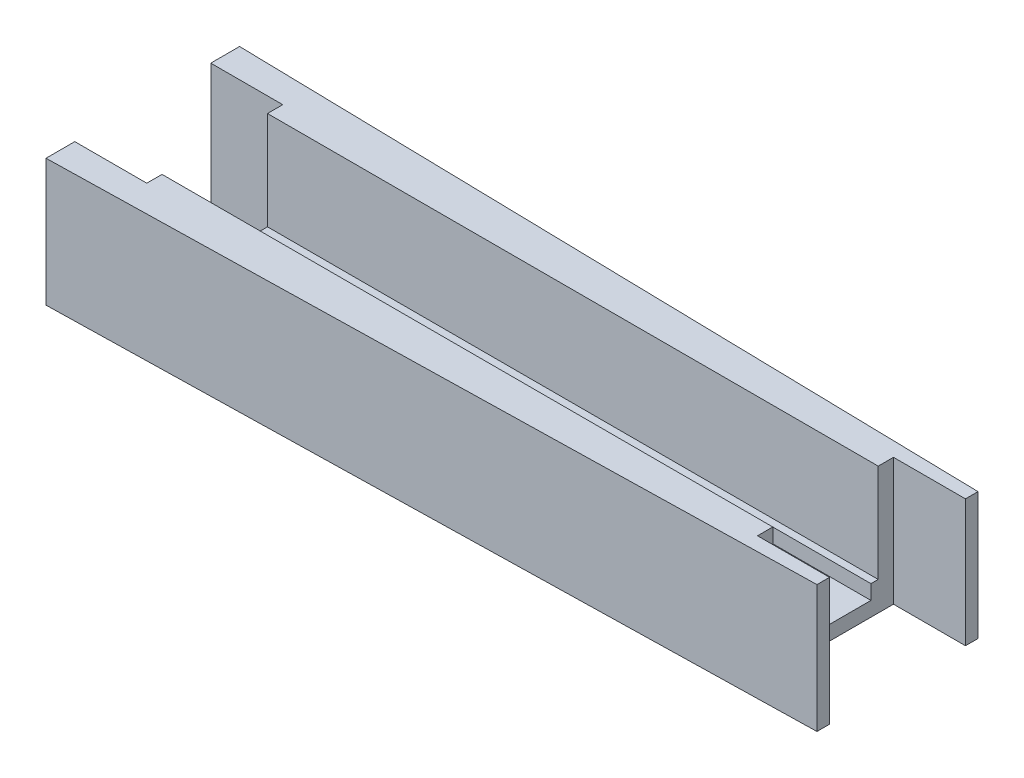
ISO-10303-21;
HEADER;
FILE_DESCRIPTION(('STEP AP214'),'2;1');
FILE_NAME('part.step','',(''),(''),'','','');
FILE_SCHEMA(('AUTOMOTIVE_DESIGN { 1 0 10303 214 1 1 1 1 }'));
ENDSEC;
DATA;
#1=APPLICATION_CONTEXT('core data for automotive mechanical design processes');
#2=APPLICATION_PROTOCOL_DEFINITION('international standard','automotive_design',2000,#1);
#3=PRODUCT_CONTEXT('',#1,'mechanical');
#4=PRODUCT('Part','Part','',(#3));
#5=PRODUCT_RELATED_PRODUCT_CATEGORY('part','',(#4));
#6=PRODUCT_DEFINITION_FORMATION('','',#4);
#7=PRODUCT_DEFINITION_CONTEXT('part definition',#1,'design');
#8=PRODUCT_DEFINITION('design','',#6,#7);
#9=PRODUCT_DEFINITION_SHAPE('','',#8);
#10=(LENGTH_UNIT() NAMED_UNIT(*) SI_UNIT(.MILLI.,.METRE.));
#11=(NAMED_UNIT(*) PLANE_ANGLE_UNIT() SI_UNIT($,.RADIAN.));
#12=(NAMED_UNIT(*) SI_UNIT($,.STERADIAN.) SOLID_ANGLE_UNIT());
#13=UNCERTAINTY_MEASURE_WITH_UNIT(LENGTH_MEASURE(1.E-05),#10,'distance_accuracy_value','');
#14=(GEOMETRIC_REPRESENTATION_CONTEXT(3) GLOBAL_UNCERTAINTY_ASSIGNED_CONTEXT((#13)) GLOBAL_UNIT_ASSIGNED_CONTEXT((#10,
#11,#12)) REPRESENTATION_CONTEXT('',''));
#15=CARTESIAN_POINT('',(0.,0.,0.));
#16=DIRECTION('',(0.,0.,1.));
#17=DIRECTION('',(1.,0.,0.));
#18=AXIS2_PLACEMENT_3D('',#15,#16,#17);
#19=CARTESIAN_POINT('',(0.,4.,0.));
#20=DIRECTION('',(0.,1.,0.));
#21=DIRECTION('',(0.,0.,1.));
#22=AXIS2_PLACEMENT_3D('',#19,#20,#21);
#23=PLANE('',#22);
#24=DIRECTION('',(1.,0.,0.));
#25=VECTOR('',#24,1.);
#26=CARTESIAN_POINT('',(15.,4.,-6.25));
#27=LINE('',#26,#25);
#28=CARTESIAN_POINT('',(88.5,4.,-6.25));
#29=VERTEX_POINT('',#28);
#30=CARTESIAN_POINT('',(172.5,4.,-6.25000000000001));
#31=VERTEX_POINT('',#30);
#32=EDGE_CURVE('E37',#29,#31,#27,.T.);
#33=ORIENTED_EDGE('',*,*,#32,.T.);
#34=DIRECTION('',(0.,0.,-1.));
#35=VECTOR('',#34,1.);
#36=CARTESIAN_POINT('',(172.5,4.,0.));
#37=LINE('',#36,#35);
#38=CARTESIAN_POINT('',(172.5,4.,-7.25));
#39=VERTEX_POINT('',#38);
#40=EDGE_CURVE('E228',#31,#39,#37,.T.);
#41=ORIENTED_EDGE('',*,*,#40,.T.);
#42=DIRECTION('',(-1.,0.,0.));
#43=VECTOR('',#42,1.);
#44=CARTESIAN_POINT('',(15.,4.,-7.25));
#45=LINE('',#44,#43);
#46=CARTESIAN_POINT('',(88.5,4.,-7.25));
#47=VERTEX_POINT('',#46);
#48=EDGE_CURVE('E226',#39,#47,#45,.T.);
#49=ORIENTED_EDGE('',*,*,#48,.T.);
#50=DIRECTION('',(0.,0.,1.));
#51=VECTOR('',#50,1.);
#52=CARTESIAN_POINT('',(88.5,4.,0.));
#53=LINE('',#52,#51);
#54=EDGE_CURVE('E225',#47,#29,#53,.T.);
#55=ORIENTED_EDGE('',*,*,#54,.T.);
#56=EDGE_LOOP('',(#33,#41,#49,#55));
#57=FACE_BOUND('',#56,.T.);
#58=ADVANCED_FACE('F33',(#57),#23,.T.);
#59=CARTESIAN_POINT('',(15.,4.,-6.25));
#60=DIRECTION('',(0.,0.,-1.));
#61=DIRECTION('',(-1.,0.,0.));
#62=AXIS2_PLACEMENT_3D('',#59,#60,#61);
#63=PLANE('',#62);
#64=DIRECTION('',(0.,-1.,0.));
#65=VECTOR('',#64,1.);
#66=CARTESIAN_POINT('',(172.5,4.,-6.25000000000001));
#67=LINE('',#66,#65);
#68=CARTESIAN_POINT('',(172.5,2.,-6.25000000000001));
#69=VERTEX_POINT('',#68);
#70=EDGE_CURVE('E240',#31,#69,#67,.T.);
#71=ORIENTED_EDGE('',*,*,#70,.F.);
#72=ORIENTED_EDGE('',*,*,#32,.F.);
#73=DIRECTION('',(0.,1.,0.));
#74=VECTOR('',#73,1.);
#75=CARTESIAN_POINT('',(88.5,4.,-6.25));
#76=LINE('',#75,#74);
#77=CARTESIAN_POINT('',(88.5,2.,-6.25000000000001));
#78=VERTEX_POINT('',#77);
#79=EDGE_CURVE('E255',#78,#29,#76,.T.);
#80=ORIENTED_EDGE('',*,*,#79,.F.);
#81=DIRECTION('',(1.,0.,0.));
#82=VECTOR('',#81,1.);
#83=CARTESIAN_POINT('',(15.,2.,-6.25));
#84=LINE('',#83,#82);
#85=EDGE_CURVE('E223',#78,#69,#84,.T.);
#86=ORIENTED_EDGE('',*,*,#85,.T.);
#87=EDGE_LOOP('',(#71,#72,#80,#86));
#88=FACE_BOUND('',#87,.T.);
#89=ADVANCED_FACE('F391',(#88),#63,.F.);
#90=CARTESIAN_POINT('',(267.,17.5,0.));
#91=DIRECTION('',(0.,1.,0.));
#92=DIRECTION('',(0.,0.,1.));
#93=AXIS2_PLACEMENT_3D('',#90,#91,#92);
#94=PLANE('',#93);
#95=DIRECTION('',(-1.,0.,0.));
#96=VECTOR('',#95,1.);
#97=CARTESIAN_POINT('',(15.,17.5,-7.25));
#98=LINE('',#97,#96);
#99=CARTESIAN_POINT('',(172.5,17.5,-7.25));
#100=VERTEX_POINT('',#99);
#101=CARTESIAN_POINT('',(88.5,17.5,-7.25));
#102=VERTEX_POINT('',#101);
#103=EDGE_CURVE('E216',#100,#102,#98,.T.);
#104=ORIENTED_EDGE('',*,*,#103,.F.);
#105=DIRECTION('',(0.,0.,1.));
#106=VECTOR('',#105,1.);
#107=CARTESIAN_POINT('',(172.5,17.5,-9.35));
#108=LINE('',#107,#106);
#109=CARTESIAN_POINT('',(172.5,17.5,-9.35));
#110=VERTEX_POINT('',#109);
#111=EDGE_CURVE('E75',#110,#100,#108,.T.);
#112=ORIENTED_EDGE('',*,*,#111,.F.);
#113=DIRECTION('',(-1.,0.,0.));
#114=VECTOR('',#113,1.);
#115=CARTESIAN_POINT('',(172.5,17.5,-9.35));
#116=LINE('',#115,#114);
#117=CARTESIAN_POINT('',(182.4,17.5,-9.35));
#118=VERTEX_POINT('',#117);
#119=EDGE_CURVE('E43',#118,#110,#116,.T.);
#120=ORIENTED_EDGE('',*,*,#119,.F.);
#121=DIRECTION('',(0.,0.,1.));
#122=VECTOR('',#121,1.);
#123=CARTESIAN_POINT('',(182.4,17.5,-9.35));
#124=LINE('',#123,#122);
#125=CARTESIAN_POINT('',(182.4,17.5,-11.0744784778008));
#126=VERTEX_POINT('',#125);
#127=EDGE_CURVE('E300',#126,#118,#124,.T.);
#128=ORIENTED_EDGE('',*,*,#127,.F.);
#129=DIRECTION('',(-0.999768082492875,0.,-0.0215355805243446));
#130=VECTOR('',#129,1.);
#131=CARTESIAN_POINT('',(0.323033707865168,17.5,-14.9965212373931));
#132=LINE('',#131,#130);
#133=CARTESIAN_POINT('',(78.6,17.5,-13.3103902833199));
#134=VERTEX_POINT('',#133);
#135=EDGE_CURVE('E207',#126,#134,#132,.T.);
#136=ORIENTED_EDGE('',*,*,#135,.T.);
#137=DIRECTION('',(0.,0.,-1.));
#138=VECTOR('',#137,1.);
#139=CARTESIAN_POINT('',(78.6,17.5,-9.35));
#140=LINE('',#139,#138);
#141=CARTESIAN_POINT('',(78.6,17.5,-9.35));
#142=VERTEX_POINT('',#141);
#143=EDGE_CURVE('E291',#142,#134,#140,.T.);
#144=ORIENTED_EDGE('',*,*,#143,.F.);
#145=DIRECTION('',(-1.,0.,0.));
#146=VECTOR('',#145,1.);
#147=CARTESIAN_POINT('',(88.5,17.5,-9.35));
#148=LINE('',#147,#146);
#149=CARTESIAN_POINT('',(88.5,17.5,-9.35));
#150=VERTEX_POINT('',#149);
#151=EDGE_CURVE('E257',#150,#142,#148,.T.);
#152=ORIENTED_EDGE('',*,*,#151,.F.);
#153=DIRECTION('',(0.,0.,-1.));
#154=VECTOR('',#153,1.);
#155=CARTESIAN_POINT('',(88.5,17.5,-9.35));
#156=LINE('',#155,#154);
#157=EDGE_CURVE('E252',#102,#150,#156,.T.);
#158=ORIENTED_EDGE('',*,*,#157,.F.);
#159=EDGE_LOOP('',(#104,#112,#120,#128,#136,#144,#152,#158));
#160=FACE_BOUND('',#159,.T.);
#161=ADVANCED_FACE('F331',(#160),#94,.T.);
#162=CARTESIAN_POINT('',(267.,0.,0.));
#163=DIRECTION('',(0.,1.,0.));
#164=DIRECTION('',(0.,0.,1.));
#165=AXIS2_PLACEMENT_3D('',#162,#163,#164);
#166=PLANE('',#165);
#167=DIRECTION('',(0.,0.,1.));
#168=VECTOR('',#167,1.);
#169=CARTESIAN_POINT('',(182.4,0.,9.35));
#170=LINE('',#169,#168);
#171=CARTESIAN_POINT('',(182.4,0.,9.35));
#172=VERTEX_POINT('',#171);
#173=CARTESIAN_POINT('',(182.4,0.,11.0744784778008));
#174=VERTEX_POINT('',#173);
#175=EDGE_CURVE('E188',#172,#174,#170,.T.);
#176=ORIENTED_EDGE('',*,*,#175,.T.);
#177=DIRECTION('',(0.999768082492875,0.,-0.0215355805243446));
#178=VECTOR('',#177,1.);
#179=CARTESIAN_POINT('',(267.19920411985,0.,9.24785476305909));
#180=LINE('',#179,#178);
#181=CARTESIAN_POINT('',(78.6,0.,13.3103902833199));
#182=VERTEX_POINT('',#181);
#183=EDGE_CURVE('E202',#182,#174,#180,.T.);
#184=ORIENTED_EDGE('',*,*,#183,.F.);
#185=DIRECTION('',(0.,0.,1.));
#186=VECTOR('',#185,1.);
#187=CARTESIAN_POINT('',(78.6,0.,0.));
#188=LINE('',#187,#186);
#189=CARTESIAN_POINT('',(78.6,0.,9.35));
#190=VERTEX_POINT('',#189);
#191=EDGE_CURVE('E253',#190,#182,#188,.T.);
#192=ORIENTED_EDGE('',*,*,#191,.F.);
#193=DIRECTION('',(1.,0.,0.));
#194=VECTOR('',#193,1.);
#195=CARTESIAN_POINT('',(88.5,0.,9.35));
#196=LINE('',#195,#194);
#197=CARTESIAN_POINT('',(88.5,0.,9.35));
#198=VERTEX_POINT('',#197);
#199=EDGE_CURVE('E206',#190,#198,#196,.T.);
#200=ORIENTED_EDGE('',*,*,#199,.T.);
#201=DIRECTION('',(0.,0.,-1.));
#202=VECTOR('',#201,1.);
#203=CARTESIAN_POINT('',(88.5,0.,-9.35));
#204=LINE('',#203,#202);
#205=CARTESIAN_POINT('',(88.5,0.,-9.35));
#206=VERTEX_POINT('',#205);
#207=EDGE_CURVE('E279',#198,#206,#204,.T.);
#208=ORIENTED_EDGE('',*,*,#207,.T.);
#209=DIRECTION('',(-1.,0.,0.));
#210=VECTOR('',#209,1.);
#211=CARTESIAN_POINT('',(88.5,0.,-9.35));
#212=LINE('',#211,#210);
#213=CARTESIAN_POINT('',(78.6,0.,-9.35));
#214=VERTEX_POINT('',#213);
#215=EDGE_CURVE('E284',#206,#214,#212,.T.);
#216=ORIENTED_EDGE('',*,*,#215,.T.);
#217=DIRECTION('',(0.,0.,-1.));
#218=VECTOR('',#217,1.);
#219=CARTESIAN_POINT('',(78.6,0.,-9.35));
#220=LINE('',#219,#218);
#221=CARTESIAN_POINT('',(78.6,0.,-13.3103902833199));
#222=VERTEX_POINT('',#221);
#223=EDGE_CURVE('E280',#214,#222,#220,.T.);
#224=ORIENTED_EDGE('',*,*,#223,.T.);
#225=DIRECTION('',(-0.999768082492875,0.,-0.0215355805243446));
#226=VECTOR('',#225,1.);
#227=CARTESIAN_POINT('',(0.323033707865168,0.,-14.9965212373931));
#228=LINE('',#227,#226);
#229=CARTESIAN_POINT('',(182.4,0.,-11.0744784778008));
#230=VERTEX_POINT('',#229);
#231=EDGE_CURVE('E212',#230,#222,#228,.T.);
#232=ORIENTED_EDGE('',*,*,#231,.F.);
#233=DIRECTION('',(0.,0.,-1.));
#234=VECTOR('',#233,1.);
#235=CARTESIAN_POINT('',(182.4,0.,0.));
#236=LINE('',#235,#234);
#237=CARTESIAN_POINT('',(182.4,0.,-9.35));
#238=VERTEX_POINT('',#237);
#239=EDGE_CURVE('E142',#238,#230,#236,.T.);
#240=ORIENTED_EDGE('',*,*,#239,.F.);
#241=DIRECTION('',(-1.,0.,0.));
#242=VECTOR('',#241,1.);
#243=CARTESIAN_POINT('',(172.5,0.,-9.35));
#244=LINE('',#243,#242);
#245=CARTESIAN_POINT('',(172.5,0.,-9.35));
#246=VERTEX_POINT('',#245);
#247=EDGE_CURVE('E283',#238,#246,#244,.T.);
#248=ORIENTED_EDGE('',*,*,#247,.T.);
#249=DIRECTION('',(0.,0.,1.));
#250=VECTOR('',#249,1.);
#251=CARTESIAN_POINT('',(172.5,0.,-9.25000000000001));
#252=LINE('',#251,#250);
#253=CARTESIAN_POINT('',(172.5,0.,9.35));
#254=VERTEX_POINT('',#253);
#255=EDGE_CURVE('E303',#246,#254,#252,.T.);
#256=ORIENTED_EDGE('',*,*,#255,.T.);
#257=DIRECTION('',(1.,0.,0.));
#258=VECTOR('',#257,1.);
#259=CARTESIAN_POINT('',(172.5,0.,9.35));
#260=LINE('',#259,#258);
#261=EDGE_CURVE('E205',#254,#172,#260,.T.);
#262=ORIENTED_EDGE('',*,*,#261,.T.);
#263=EDGE_LOOP('',(#176,#184,#192,#200,#208,#216,#224,#232,#240,#248,#256,#262));
#264=FACE_BOUND('',#263,.T.);
#265=ADVANCED_FACE('F200',(#264),#166,.F.);
#266=DIRECTION('',(1.,0.,0.));
#267=VECTOR('',#266,1.);
#268=CARTESIAN_POINT('',(172.5,17.5,9.35));
#269=LINE('',#268,#267);
#270=CARTESIAN_POINT('',(172.5,17.5,9.35));
#271=VERTEX_POINT('',#270);
#272=CARTESIAN_POINT('',(182.4,17.5,9.35));
#273=VERTEX_POINT('',#272);
#274=EDGE_CURVE('E67',#271,#273,#269,.T.);
#275=ORIENTED_EDGE('',*,*,#274,.F.);
#276=CARTESIAN_POINT('',(172.5,17.5,7.25));
#277=VERTEX_POINT('',#276);
#278=EDGE_CURVE('E249',#277,#271,#108,.T.);
#279=ORIENTED_EDGE('',*,*,#278,.F.);
#280=DIRECTION('',(1.,0.,0.));
#281=VECTOR('',#280,1.);
#282=CARTESIAN_POINT('',(15.,17.5,7.25));
#283=LINE('',#282,#281);
#284=CARTESIAN_POINT('',(88.5,17.5,7.25));
#285=VERTEX_POINT('',#284);
#286=EDGE_CURVE('E246',#285,#277,#283,.T.);
#287=ORIENTED_EDGE('',*,*,#286,.F.);
#288=CARTESIAN_POINT('',(88.5,17.5,9.35));
#289=VERTEX_POINT('',#288);
#290=EDGE_CURVE('E265',#289,#285,#156,.T.);
#291=ORIENTED_EDGE('',*,*,#290,.F.);
#292=DIRECTION('',(1.,0.,0.));
#293=VECTOR('',#292,1.);
#294=CARTESIAN_POINT('',(88.5,17.5,9.35));
#295=LINE('',#294,#293);
#296=CARTESIAN_POINT('',(78.6,17.5,9.35));
#297=VERTEX_POINT('',#296);
#298=EDGE_CURVE('E272',#297,#289,#295,.T.);
#299=ORIENTED_EDGE('',*,*,#298,.F.);
#300=DIRECTION('',(0.,0.,-1.));
#301=VECTOR('',#300,1.);
#302=CARTESIAN_POINT('',(78.6,17.5,9.35));
#303=LINE('',#302,#301);
#304=CARTESIAN_POINT('',(78.6,17.5,13.3103902833199));
#305=VERTEX_POINT('',#304);
#306=EDGE_CURVE('E275',#305,#297,#303,.T.);
#307=ORIENTED_EDGE('',*,*,#306,.F.);
#308=DIRECTION('',(0.999768082492875,0.,-0.0215355805243446));
#309=VECTOR('',#308,1.);
#310=CARTESIAN_POINT('',(267.19920411985,17.5,9.24785476305909));
#311=LINE('',#310,#309);
#312=CARTESIAN_POINT('',(182.4,17.5,11.0744784778008));
#313=VERTEX_POINT('',#312);
#314=EDGE_CURVE('E213',#305,#313,#311,.T.);
#315=ORIENTED_EDGE('',*,*,#314,.T.);
#316=DIRECTION('',(0.,0.,1.));
#317=VECTOR('',#316,1.);
#318=CARTESIAN_POINT('',(182.4,17.5,9.35));
#319=LINE('',#318,#317);
#320=EDGE_CURVE('E191',#273,#313,#319,.T.);
#321=ORIENTED_EDGE('',*,*,#320,.F.);
#322=EDGE_LOOP('',(#275,#279,#287,#291,#299,#307,#315,#321));
#323=FACE_BOUND('',#322,.T.);
#324=ADVANCED_FACE('F351',(#323),#94,.T.);
#325=CARTESIAN_POINT('',(267.19920411985,17.5,9.24785476305909));
#326=DIRECTION('',(-0.0215355805243446,0.,-0.999768082492875));
#327=DIRECTION('',(-0.999768082492875,0.,0.0215355805243446));
#328=AXIS2_PLACEMENT_3D('',#325,#326,#327);
#329=PLANE('',#328);
#330=DIRECTION('',(0.,-1.,0.));
#331=VECTOR('',#330,1.);
#332=CARTESIAN_POINT('',(182.4,17.5,11.0744784778008));
#333=LINE('',#332,#331);
#334=EDGE_CURVE('E185',#313,#174,#333,.T.);
#335=ORIENTED_EDGE('',*,*,#334,.F.);
#336=ORIENTED_EDGE('',*,*,#314,.F.);
#337=DIRECTION('',(0.,1.,0.));
#338=VECTOR('',#337,1.);
#339=CARTESIAN_POINT('',(78.6,17.5,13.3103902833199));
#340=LINE('',#339,#338);
#341=EDGE_CURVE('E211',#182,#305,#340,.T.);
#342=ORIENTED_EDGE('',*,*,#341,.F.);
#343=ORIENTED_EDGE('',*,*,#183,.T.);
#344=EDGE_LOOP('',(#335,#336,#342,#343));
#345=FACE_BOUND('',#344,.T.);
#346=ADVANCED_FACE('F210',(#345),#329,.F.);
#347=CARTESIAN_POINT('',(0.323033707865168,17.5,-14.9965212373931));
#348=DIRECTION('',(-0.0215355805243446,0.,0.999768082492875));
#349=DIRECTION('',(0.999768082492875,0.,0.0215355805243446));
#350=AXIS2_PLACEMENT_3D('',#347,#348,#349);
#351=PLANE('',#350);
#352=DIRECTION('',(0.,1.,0.));
#353=VECTOR('',#352,1.);
#354=CARTESIAN_POINT('',(182.4,17.5,-11.0744784778008));
#355=LINE('',#354,#353);
#356=EDGE_CURVE('E309',#230,#126,#355,.T.);
#357=ORIENTED_EDGE('',*,*,#356,.F.);
#358=ORIENTED_EDGE('',*,*,#231,.T.);
#359=DIRECTION('',(0.,-1.,0.));
#360=VECTOR('',#359,1.);
#361=CARTESIAN_POINT('',(78.6,17.5,-13.3103902833199));
#362=LINE('',#361,#360);
#363=EDGE_CURVE('E261',#134,#222,#362,.T.);
#364=ORIENTED_EDGE('',*,*,#363,.F.);
#365=ORIENTED_EDGE('',*,*,#135,.F.);
#366=EDGE_LOOP('',(#357,#358,#364,#365));
#367=FACE_BOUND('',#366,.T.);
#368=ADVANCED_FACE('F378',(#367),#351,.F.);
#369=CARTESIAN_POINT('',(15.,2.,-7.25));
#370=DIRECTION('',(0.,0.,-1.));
#371=DIRECTION('',(-1.,0.,0.));
#372=AXIS2_PLACEMENT_3D('',#369,#370,#371);
#373=PLANE('',#372);
#374=DIRECTION('',(0.,-1.,0.));
#375=VECTOR('',#374,1.);
#376=CARTESIAN_POINT('',(172.5,2.,-7.25));
#377=LINE('',#376,#375);
#378=EDGE_CURVE('E238',#100,#39,#377,.T.);
#379=ORIENTED_EDGE('',*,*,#378,.F.);
#380=ORIENTED_EDGE('',*,*,#103,.T.);
#381=DIRECTION('',(0.,1.,0.));
#382=VECTOR('',#381,1.);
#383=CARTESIAN_POINT('',(88.5,2.,-7.25));
#384=LINE('',#383,#382);
#385=EDGE_CURVE('E251',#47,#102,#384,.T.);
#386=ORIENTED_EDGE('',*,*,#385,.F.);
#387=ORIENTED_EDGE('',*,*,#48,.F.);
#388=EDGE_LOOP('',(#379,#380,#386,#387));
#389=FACE_BOUND('',#388,.T.);
#390=ADVANCED_FACE('F328',(#389),#373,.F.);
#391=CARTESIAN_POINT('',(0.,4.,0.));
#392=DIRECTION('',(0.,1.,0.));
#393=DIRECTION('',(0.,0.,1.));
#394=AXIS2_PLACEMENT_3D('',#391,#392,#393);
#395=PLANE('',#394);
#396=DIRECTION('',(1.,0.,0.));
#397=VECTOR('',#396,1.);
#398=CARTESIAN_POINT('',(267.,4.,7.25));
#399=LINE('',#398,#397);
#400=CARTESIAN_POINT('',(88.5,4.,7.25000000000002));
#401=VERTEX_POINT('',#400);
#402=CARTESIAN_POINT('',(172.5,4.,7.25));
#403=VERTEX_POINT('',#402);
#404=EDGE_CURVE('E322',#401,#403,#399,.T.);
#405=ORIENTED_EDGE('',*,*,#404,.T.);
#406=DIRECTION('',(0.,0.,-1.));
#407=VECTOR('',#406,1.);
#408=CARTESIAN_POINT('',(172.5,4.,0.));
#409=LINE('',#408,#407);
#410=CARTESIAN_POINT('',(172.5,4.,6.25000000000001));
#411=VERTEX_POINT('',#410);
#412=EDGE_CURVE('E172',#403,#411,#409,.T.);
#413=ORIENTED_EDGE('',*,*,#412,.T.);
#414=DIRECTION('',(-1.,0.,0.));
#415=VECTOR('',#414,1.);
#416=CARTESIAN_POINT('',(267.,4.,6.25));
#417=LINE('',#416,#415);
#418=CARTESIAN_POINT('',(88.5,4.,6.25));
#419=VERTEX_POINT('',#418);
#420=EDGE_CURVE('E319',#411,#419,#417,.T.);
#421=ORIENTED_EDGE('',*,*,#420,.T.);
#422=DIRECTION('',(0.,0.,1.));
#423=VECTOR('',#422,1.);
#424=CARTESIAN_POINT('',(88.5,4.,0.));
#425=LINE('',#424,#423);
#426=EDGE_CURVE('E318',#419,#401,#425,.T.);
#427=ORIENTED_EDGE('',*,*,#426,.T.);
#428=EDGE_LOOP('',(#405,#413,#421,#427));
#429=FACE_BOUND('',#428,.T.);
#430=ADVANCED_FACE('F361',(#429),#395,.T.);
#431=CARTESIAN_POINT('',(267.,4.,6.25));
#432=DIRECTION('',(0.,0.,1.));
#433=DIRECTION('',(1.,0.,0.));
#434=AXIS2_PLACEMENT_3D('',#431,#432,#433);
#435=PLANE('',#434);
#436=DIRECTION('',(0.,1.,0.));
#437=VECTOR('',#436,1.);
#438=CARTESIAN_POINT('',(172.5,4.,6.25000000000001));
#439=LINE('',#438,#437);
#440=CARTESIAN_POINT('',(172.5,2.,6.25000000000001));
#441=VERTEX_POINT('',#440);
#442=EDGE_CURVE('E176',#441,#411,#439,.T.);
#443=ORIENTED_EDGE('',*,*,#442,.F.);
#444=DIRECTION('',(-1.,0.,0.));
#445=VECTOR('',#444,1.);
#446=CARTESIAN_POINT('',(267.,2.,6.25));
#447=LINE('',#446,#445);
#448=CARTESIAN_POINT('',(88.5,2.,6.25000000000002));
#449=VERTEX_POINT('',#448);
#450=EDGE_CURVE('E315',#441,#449,#447,.T.);
#451=ORIENTED_EDGE('',*,*,#450,.T.);
#452=DIRECTION('',(0.,-1.,0.));
#453=VECTOR('',#452,1.);
#454=CARTESIAN_POINT('',(88.5,4.,6.25000000000002));
#455=LINE('',#454,#453);
#456=EDGE_CURVE('E258',#419,#449,#455,.T.);
#457=ORIENTED_EDGE('',*,*,#456,.F.);
#458=ORIENTED_EDGE('',*,*,#420,.F.);
#459=EDGE_LOOP('',(#443,#451,#457,#458));
#460=FACE_BOUND('',#459,.T.);
#461=ADVANCED_FACE('F403',(#460),#435,.F.);
#462=CARTESIAN_POINT('',(15.,2.,7.25));
#463=DIRECTION('',(0.,0.,1.));
#464=DIRECTION('',(1.,0.,0.));
#465=AXIS2_PLACEMENT_3D('',#462,#463,#464);
#466=PLANE('',#465);
#467=DIRECTION('',(0.,1.,0.));
#468=VECTOR('',#467,1.);
#469=CARTESIAN_POINT('',(172.5,2.,7.25));
#470=LINE('',#469,#468);
#471=EDGE_CURVE('E247',#403,#277,#470,.T.);
#472=ORIENTED_EDGE('',*,*,#471,.F.);
#473=ORIENTED_EDGE('',*,*,#404,.F.);
#474=DIRECTION('',(0.,-1.,0.));
#475=VECTOR('',#474,1.);
#476=CARTESIAN_POINT('',(88.5,2.,7.25));
#477=LINE('',#476,#475);
#478=EDGE_CURVE('E262',#285,#401,#477,.T.);
#479=ORIENTED_EDGE('',*,*,#478,.F.);
#480=ORIENTED_EDGE('',*,*,#286,.T.);
#481=EDGE_LOOP('',(#472,#473,#479,#480));
#482=FACE_BOUND('',#481,.T.);
#483=ADVANCED_FACE('F356',(#482),#466,.F.);
#484=CARTESIAN_POINT('',(0.,2.,0.));
#485=DIRECTION('',(0.,1.,0.));
#486=DIRECTION('',(0.,0.,1.));
#487=AXIS2_PLACEMENT_3D('',#484,#485,#486);
#488=PLANE('',#487);
#489=ORIENTED_EDGE('',*,*,#450,.F.);
#490=DIRECTION('',(0.,0.,-1.));
#491=VECTOR('',#490,1.);
#492=CARTESIAN_POINT('',(172.5,2.,0.));
#493=LINE('',#492,#491);
#494=EDGE_CURVE('E242',#441,#69,#493,.T.);
#495=ORIENTED_EDGE('',*,*,#494,.T.);
#496=ORIENTED_EDGE('',*,*,#85,.F.);
#497=DIRECTION('',(0.,0.,1.));
#498=VECTOR('',#497,1.);
#499=CARTESIAN_POINT('',(88.5,2.,0.));
#500=LINE('',#499,#498);
#501=EDGE_CURVE('E245',#78,#449,#500,.T.);
#502=ORIENTED_EDGE('',*,*,#501,.T.);
#503=EDGE_LOOP('',(#489,#495,#496,#502));
#504=FACE_BOUND('',#503,.T.);
#505=ADVANCED_FACE('F35',(#504),#488,.T.);
#506=CARTESIAN_POINT('',(78.6,17.5,-9.35));
#507=DIRECTION('',(-1.,0.,0.));
#508=DIRECTION('',(0.,0.,1.));
#509=AXIS2_PLACEMENT_3D('',#506,#507,#508);
#510=PLANE('',#509);
#511=ORIENTED_EDGE('',*,*,#363,.T.);
#512=ORIENTED_EDGE('',*,*,#223,.F.);
#513=DIRECTION('',(0.,-1.,0.));
#514=VECTOR('',#513,1.);
#515=CARTESIAN_POINT('',(78.6,17.5,-9.35));
#516=LINE('',#515,#514);
#517=EDGE_CURVE('E270',#142,#214,#516,.T.);
#518=ORIENTED_EDGE('',*,*,#517,.F.);
#519=ORIENTED_EDGE('',*,*,#143,.T.);
#520=EDGE_LOOP('',(#511,#512,#518,#519));
#521=FACE_BOUND('',#520,.T.);
#522=ADVANCED_FACE('F380',(#521),#510,.T.);
#523=CARTESIAN_POINT('',(78.6,17.5,9.35));
#524=DIRECTION('',(-1.,0.,0.));
#525=DIRECTION('',(0.,0.,1.));
#526=AXIS2_PLACEMENT_3D('',#523,#524,#525);
#527=PLANE('',#526);
#528=ORIENTED_EDGE('',*,*,#341,.T.);
#529=ORIENTED_EDGE('',*,*,#306,.T.);
#530=DIRECTION('',(0.,-1.,0.));
#531=VECTOR('',#530,1.);
#532=CARTESIAN_POINT('',(78.6,17.5,9.35));
#533=LINE('',#532,#531);
#534=EDGE_CURVE('E273',#297,#190,#533,.T.);
#535=ORIENTED_EDGE('',*,*,#534,.T.);
#536=ORIENTED_EDGE('',*,*,#191,.T.);
#537=EDGE_LOOP('',(#528,#529,#535,#536));
#538=FACE_BOUND('',#537,.T.);
#539=ADVANCED_FACE('F369',(#538),#527,.T.);
#540=CARTESIAN_POINT('',(88.5,17.5,-9.35));
#541=DIRECTION('',(-1.,0.,0.));
#542=DIRECTION('',(0.,0.,1.));
#543=AXIS2_PLACEMENT_3D('',#540,#541,#542);
#544=PLANE('',#543);
#545=ORIENTED_EDGE('',*,*,#385,.T.);
#546=ORIENTED_EDGE('',*,*,#157,.T.);
#547=DIRECTION('',(0.,-1.,0.));
#548=VECTOR('',#547,1.);
#549=CARTESIAN_POINT('',(88.5,17.5,-9.35));
#550=LINE('',#549,#548);
#551=EDGE_CURVE('E267',#150,#206,#550,.T.);
#552=ORIENTED_EDGE('',*,*,#551,.T.);
#553=ORIENTED_EDGE('',*,*,#207,.F.);
#554=DIRECTION('',(0.,-1.,0.));
#555=VECTOR('',#554,1.);
#556=CARTESIAN_POINT('',(88.5,17.5,9.35));
#557=LINE('',#556,#555);
#558=EDGE_CURVE('E196',#289,#198,#557,.T.);
#559=ORIENTED_EDGE('',*,*,#558,.F.);
#560=ORIENTED_EDGE('',*,*,#290,.T.);
#561=ORIENTED_EDGE('',*,*,#478,.T.);
#562=ORIENTED_EDGE('',*,*,#426,.F.);
#563=ORIENTED_EDGE('',*,*,#456,.T.);
#564=ORIENTED_EDGE('',*,*,#501,.F.);
#565=ORIENTED_EDGE('',*,*,#79,.T.);
#566=ORIENTED_EDGE('',*,*,#54,.F.);
#567=EDGE_LOOP('',(#545,#546,#552,#553,#559,#560,#561,#562,#563,#564,#565,#566));
#568=FACE_BOUND('',#567,.T.);
#569=ADVANCED_FACE('F336',(#568),#544,.T.);
#570=CARTESIAN_POINT('',(88.5,17.5,-9.35));
#571=DIRECTION('',(0.,0.,1.));
#572=DIRECTION('',(1.,0.,0.));
#573=AXIS2_PLACEMENT_3D('',#570,#571,#572);
#574=PLANE('',#573);
#575=ORIENTED_EDGE('',*,*,#215,.F.);
#576=ORIENTED_EDGE('',*,*,#551,.F.);
#577=ORIENTED_EDGE('',*,*,#151,.T.);
#578=ORIENTED_EDGE('',*,*,#517,.T.);
#579=EDGE_LOOP('',(#575,#576,#577,#578));
#580=FACE_BOUND('',#579,.T.);
#581=ADVANCED_FACE('F339',(#580),#574,.T.);
#582=CARTESIAN_POINT('',(88.5,17.5,9.35));
#583=DIRECTION('',(0.,0.,-1.));
#584=DIRECTION('',(-1.,0.,0.));
#585=AXIS2_PLACEMENT_3D('',#582,#583,#584);
#586=PLANE('',#585);
#587=ORIENTED_EDGE('',*,*,#199,.F.);
#588=ORIENTED_EDGE('',*,*,#534,.F.);
#589=ORIENTED_EDGE('',*,*,#298,.T.);
#590=ORIENTED_EDGE('',*,*,#558,.T.);
#591=EDGE_LOOP('',(#587,#588,#589,#590));
#592=FACE_BOUND('',#591,.T.);
#593=ADVANCED_FACE('F477',(#592),#586,.T.);
#594=CARTESIAN_POINT('',(182.4,17.5,9.35));
#595=DIRECTION('',(1.,0.,0.));
#596=DIRECTION('',(0.,0.,-1.));
#597=AXIS2_PLACEMENT_3D('',#594,#595,#596);
#598=PLANE('',#597);
#599=ORIENTED_EDGE('',*,*,#334,.T.);
#600=ORIENTED_EDGE('',*,*,#175,.F.);
#601=DIRECTION('',(0.,-1.,0.));
#602=VECTOR('',#601,1.);
#603=CARTESIAN_POINT('',(182.4,17.5,9.35));
#604=LINE('',#603,#602);
#605=EDGE_CURVE('E298',#273,#172,#604,.T.);
#606=ORIENTED_EDGE('',*,*,#605,.F.);
#607=ORIENTED_EDGE('',*,*,#320,.T.);
#608=EDGE_LOOP('',(#599,#600,#606,#607));
#609=FACE_BOUND('',#608,.T.);
#610=ADVANCED_FACE('F187',(#609),#598,.T.);
#611=CARTESIAN_POINT('',(182.4,17.5,-9.35));
#612=DIRECTION('',(1.,0.,0.));
#613=DIRECTION('',(0.,0.,-1.));
#614=AXIS2_PLACEMENT_3D('',#611,#612,#613);
#615=PLANE('',#614);
#616=ORIENTED_EDGE('',*,*,#356,.T.);
#617=ORIENTED_EDGE('',*,*,#127,.T.);
#618=DIRECTION('',(0.,-1.,0.));
#619=VECTOR('',#618,1.);
#620=CARTESIAN_POINT('',(182.4,17.5,-9.35));
#621=LINE('',#620,#619);
#622=EDGE_CURVE('E136',#118,#238,#621,.T.);
#623=ORIENTED_EDGE('',*,*,#622,.T.);
#624=ORIENTED_EDGE('',*,*,#239,.T.);
#625=EDGE_LOOP('',(#616,#617,#623,#624));
#626=FACE_BOUND('',#625,.T.);
#627=ADVANCED_FACE('F493',(#626),#615,.T.);
#628=CARTESIAN_POINT('',(172.5,17.5,-9.25000000000001));
#629=DIRECTION('',(1.,0.,0.));
#630=DIRECTION('',(0.,0.,-1.));
#631=AXIS2_PLACEMENT_3D('',#628,#629,#630);
#632=PLANE('',#631);
#633=ORIENTED_EDGE('',*,*,#378,.T.);
#634=ORIENTED_EDGE('',*,*,#40,.F.);
#635=ORIENTED_EDGE('',*,*,#70,.T.);
#636=ORIENTED_EDGE('',*,*,#494,.F.);
#637=ORIENTED_EDGE('',*,*,#442,.T.);
#638=ORIENTED_EDGE('',*,*,#412,.F.);
#639=ORIENTED_EDGE('',*,*,#471,.T.);
#640=ORIENTED_EDGE('',*,*,#278,.T.);
#641=DIRECTION('',(0.,-1.,0.));
#642=VECTOR('',#641,1.);
#643=CARTESIAN_POINT('',(172.5,17.5,9.35));
#644=LINE('',#643,#642);
#645=EDGE_CURVE('E295',#271,#254,#644,.T.);
#646=ORIENTED_EDGE('',*,*,#645,.T.);
#647=ORIENTED_EDGE('',*,*,#255,.F.);
#648=DIRECTION('',(0.,-1.,0.));
#649=VECTOR('',#648,1.);
#650=CARTESIAN_POINT('',(172.5,17.5,-9.35));
#651=LINE('',#650,#649);
#652=EDGE_CURVE('E11',#110,#246,#651,.T.);
#653=ORIENTED_EDGE('',*,*,#652,.F.);
#654=ORIENTED_EDGE('',*,*,#111,.T.);
#655=EDGE_LOOP('',(#633,#634,#635,#636,#637,#638,#639,#640,#646,#647,#653,#654));
#656=FACE_BOUND('',#655,.T.);
#657=ADVANCED_FACE('F371',(#656),#632,.T.);
#658=CARTESIAN_POINT('',(172.5,17.5,9.35));
#659=DIRECTION('',(0.,0.,-1.));
#660=DIRECTION('',(-1.,0.,0.));
#661=AXIS2_PLACEMENT_3D('',#658,#659,#660);
#662=PLANE('',#661);
#663=ORIENTED_EDGE('',*,*,#261,.F.);
#664=ORIENTED_EDGE('',*,*,#645,.F.);
#665=ORIENTED_EDGE('',*,*,#274,.T.);
#666=ORIENTED_EDGE('',*,*,#605,.T.);
#667=EDGE_LOOP('',(#663,#664,#665,#666));
#668=FACE_BOUND('',#667,.T.);
#669=ADVANCED_FACE('F372',(#668),#662,.T.);
#670=CARTESIAN_POINT('',(172.5,17.5,-9.35));
#671=DIRECTION('',(0.,0.,1.));
#672=DIRECTION('',(1.,0.,0.));
#673=AXIS2_PLACEMENT_3D('',#670,#671,#672);
#674=PLANE('',#673);
#675=ORIENTED_EDGE('',*,*,#247,.F.);
#676=ORIENTED_EDGE('',*,*,#622,.F.);
#677=ORIENTED_EDGE('',*,*,#119,.T.);
#678=ORIENTED_EDGE('',*,*,#652,.T.);
#679=EDGE_LOOP('',(#675,#676,#677,#678));
#680=FACE_BOUND('',#679,.T.);
#681=ADVANCED_FACE('F373',(#680),#674,.T.);
#682=CLOSED_SHELL('',(#58,#89,#161,#265,#324,#346,#368,#390,#430,#461,#483,#505,#522,#539,#569,
#581,#593,#610,#627,#657,#669,#681));
#683=MANIFOLD_SOLID_BREP('B2',#682);
#684=ADVANCED_BREP_SHAPE_REPRESENTATION('',(#18,#683),#14);
#685=SHAPE_DEFINITION_REPRESENTATION(#9,#684);
ENDSEC;
END-ISO-10303-21;
